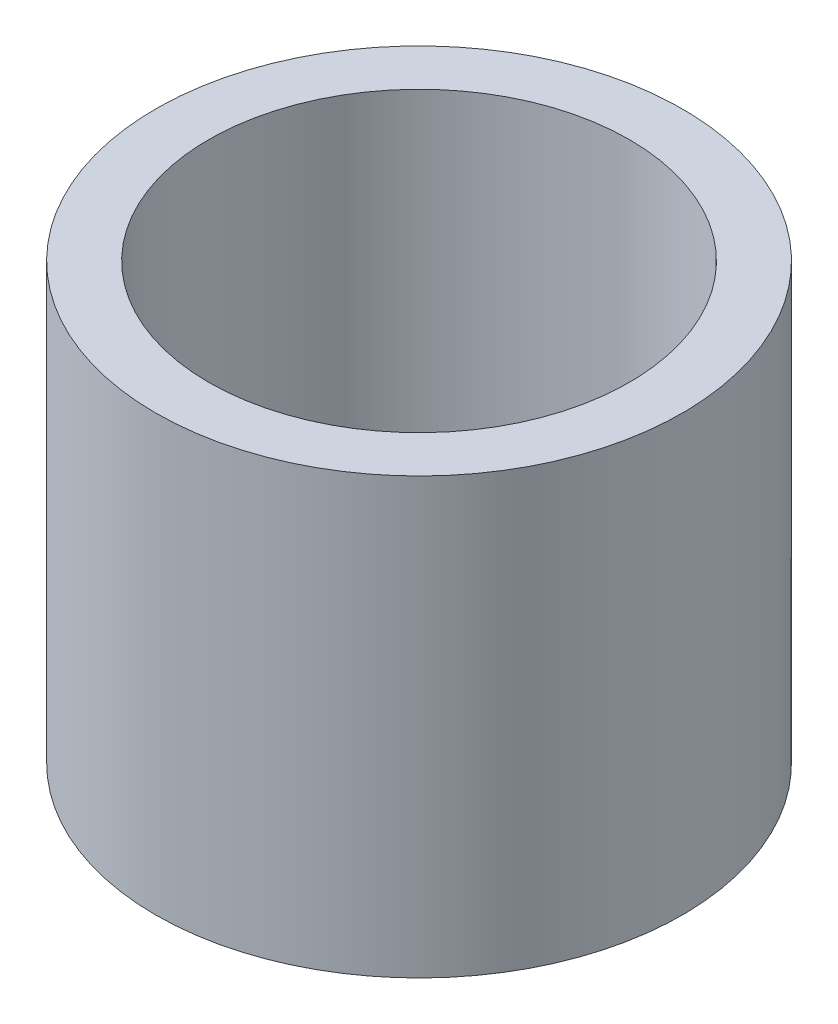
ISO-10303-21;
HEADER;
FILE_DESCRIPTION(('STEP AP214'),'2;1');
FILE_NAME('part.step','',(''),(''),'','','');
FILE_SCHEMA(('AUTOMOTIVE_DESIGN { 1 0 10303 214 1 1 1 1 }'));
ENDSEC;
DATA;
#1=APPLICATION_CONTEXT('core data for automotive mechanical design processes');
#2=APPLICATION_PROTOCOL_DEFINITION('international standard','automotive_design',2000,#1);
#3=PRODUCT_CONTEXT('',#1,'mechanical');
#4=PRODUCT('Part','Part','',(#3));
#5=PRODUCT_RELATED_PRODUCT_CATEGORY('part','',(#4));
#6=PRODUCT_DEFINITION_FORMATION('','',#4);
#7=PRODUCT_DEFINITION_CONTEXT('part definition',#1,'design');
#8=PRODUCT_DEFINITION('design','',#6,#7);
#9=PRODUCT_DEFINITION_SHAPE('','',#8);
#10=(LENGTH_UNIT() NAMED_UNIT(*) SI_UNIT(.MILLI.,.METRE.));
#11=(NAMED_UNIT(*) PLANE_ANGLE_UNIT() SI_UNIT($,.RADIAN.));
#12=(NAMED_UNIT(*) SI_UNIT($,.STERADIAN.) SOLID_ANGLE_UNIT());
#13=UNCERTAINTY_MEASURE_WITH_UNIT(LENGTH_MEASURE(1.E-05),#10,'distance_accuracy_value','');
#14=(GEOMETRIC_REPRESENTATION_CONTEXT(3) GLOBAL_UNCERTAINTY_ASSIGNED_CONTEXT((#13)) GLOBAL_UNIT_ASSIGNED_CONTEXT((#10,
#11,#12)) REPRESENTATION_CONTEXT('',''));
#15=CARTESIAN_POINT('',(0.,0.,0.));
#16=DIRECTION('',(0.,0.,1.));
#17=DIRECTION('',(1.,0.,0.));
#18=AXIS2_PLACEMENT_3D('',#15,#16,#17);
#19=CARTESIAN_POINT('',(0.,37.1399890472079,0.));
#20=DIRECTION('',(0.,-1.,0.));
#21=DIRECTION('',(0.,0.,-1.));
#22=AXIS2_PLACEMENT_3D('',#19,#20,#21);
#23=CYLINDRICAL_SURFACE('',#22,22.5);
#24=CARTESIAN_POINT('',(0.,37.1399890472079,0.));
#25=DIRECTION('',(0.,1.,0.));
#26=DIRECTION('',(0.,0.,1.));
#27=AXIS2_PLACEMENT_3D('',#24,#25,#26);
#28=CIRCLE('',#27,22.5);
#29=CARTESIAN_POINT('',(0.,37.1399890472079,22.5));
#30=VERTEX_POINT('',#29);
#31=EDGE_CURVE('E10',#30,#30,#28,.T.);
#32=ORIENTED_EDGE('',*,*,#31,.F.);
#33=EDGE_LOOP('',(#32));
#34=FACE_BOUND('',#33,.T.);
#35=CARTESIAN_POINT('',(0.,0.,0.));
#36=DIRECTION('',(0.,1.,0.));
#37=DIRECTION('',(0.,0.,1.));
#38=AXIS2_PLACEMENT_3D('',#35,#36,#37);
#39=CIRCLE('',#38,22.5);
#40=CARTESIAN_POINT('',(0.,0.,22.5));
#41=VERTEX_POINT('',#40);
#42=EDGE_CURVE('E37',#41,#41,#39,.T.);
#43=ORIENTED_EDGE('',*,*,#42,.T.);
#44=EDGE_LOOP('',(#43));
#45=FACE_BOUND('',#44,.T.);
#46=ADVANCED_FACE('F40',(#34,#45),#23,.T.);
#47=CARTESIAN_POINT('',(0.,37.1399890472079,0.));
#48=DIRECTION('',(0.,1.,0.));
#49=DIRECTION('',(0.,0.,1.));
#50=AXIS2_PLACEMENT_3D('',#47,#48,#49);
#51=PLANE('',#50);
#52=CARTESIAN_POINT('',(0.,37.1399890472079,0.));
#53=DIRECTION('',(0.,1.,0.));
#54=DIRECTION('',(0.,0.,1.));
#55=AXIS2_PLACEMENT_3D('',#52,#53,#54);
#56=CIRCLE('',#55,17.9674438050413);
#57=CARTESIAN_POINT('',(0.,37.1399890472079,17.9674438050413));
#58=VERTEX_POINT('',#57);
#59=EDGE_CURVE('E50',#58,#58,#56,.T.);
#60=ORIENTED_EDGE('',*,*,#59,.F.);
#61=EDGE_LOOP('',(#60));
#62=FACE_BOUND('',#61,.T.);
#63=ORIENTED_EDGE('',*,*,#31,.T.);
#64=EDGE_LOOP('',(#63));
#65=FACE_BOUND('',#64,.T.);
#66=ADVANCED_FACE('F59',(#62,#65),#51,.T.);
#67=CARTESIAN_POINT('',(0.,0.,0.));
#68=DIRECTION('',(0.,1.,0.));
#69=DIRECTION('',(0.,0.,1.));
#70=AXIS2_PLACEMENT_3D('',#67,#68,#69);
#71=PLANE('',#70);
#72=CARTESIAN_POINT('',(0.,0.,0.));
#73=DIRECTION('',(0.,1.,0.));
#74=DIRECTION('',(0.,0.,1.));
#75=AXIS2_PLACEMENT_3D('',#72,#73,#74);
#76=CIRCLE('',#75,17.9674438050413);
#77=CARTESIAN_POINT('',(0.,0.,17.9674438050413));
#78=VERTEX_POINT('',#77);
#79=EDGE_CURVE('E47',#78,#78,#76,.T.);
#80=ORIENTED_EDGE('',*,*,#79,.T.);
#81=EDGE_LOOP('',(#80));
#82=FACE_BOUND('',#81,.T.);
#83=ORIENTED_EDGE('',*,*,#42,.F.);
#84=EDGE_LOOP('',(#83));
#85=FACE_BOUND('',#84,.T.);
#86=ADVANCED_FACE('F58',(#82,#85),#71,.F.);
#87=CARTESIAN_POINT('',(0.,37.1399890472079,0.));
#88=DIRECTION('',(0.,-1.,0.));
#89=DIRECTION('',(0.,0.,-1.));
#90=AXIS2_PLACEMENT_3D('',#87,#88,#89);
#91=CYLINDRICAL_SURFACE('',#90,17.9674438050413);
#92=ORIENTED_EDGE('',*,*,#59,.T.);
#93=EDGE_LOOP('',(#92));
#94=FACE_BOUND('',#93,.T.);
#95=ORIENTED_EDGE('',*,*,#79,.F.);
#96=EDGE_LOOP('',(#95));
#97=FACE_BOUND('',#96,.T.);
#98=ADVANCED_FACE('F54',(#94,#97),#91,.F.);
#99=CLOSED_SHELL('',(#46,#66,#86,#98));
#100=MANIFOLD_SOLID_BREP('B2',#99);
#101=ADVANCED_BREP_SHAPE_REPRESENTATION('',(#18,#100),#14);
#102=SHAPE_DEFINITION_REPRESENTATION(#9,#101);
ENDSEC;
END-ISO-10303-21;
